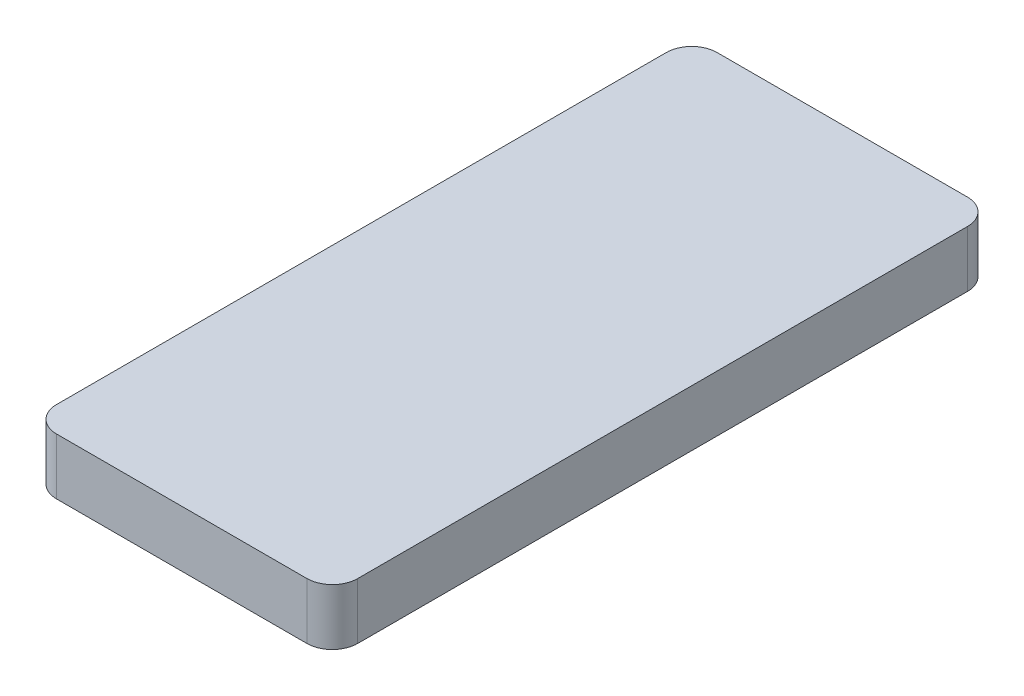
ISO-10303-21;
HEADER;
FILE_DESCRIPTION(('STEP AP214'),'2;1');
FILE_NAME('part.step','',(''),(''),'','','');
FILE_SCHEMA(('AUTOMOTIVE_DESIGN { 1 0 10303 214 1 1 1 1 }'));
ENDSEC;
DATA;
#1=APPLICATION_CONTEXT('core data for automotive mechanical design processes');
#2=APPLICATION_PROTOCOL_DEFINITION('international standard','automotive_design',2000,#1);
#3=PRODUCT_CONTEXT('',#1,'mechanical');
#4=PRODUCT('Part','Part','',(#3));
#5=PRODUCT_RELATED_PRODUCT_CATEGORY('part','',(#4));
#6=PRODUCT_DEFINITION_FORMATION('','',#4);
#7=PRODUCT_DEFINITION_CONTEXT('part definition',#1,'design');
#8=PRODUCT_DEFINITION('design','',#6,#7);
#9=PRODUCT_DEFINITION_SHAPE('','',#8);
#10=(LENGTH_UNIT() NAMED_UNIT(*) SI_UNIT(.MILLI.,.METRE.));
#11=(NAMED_UNIT(*) PLANE_ANGLE_UNIT() SI_UNIT($,.RADIAN.));
#12=(NAMED_UNIT(*) SI_UNIT($,.STERADIAN.) SOLID_ANGLE_UNIT());
#13=UNCERTAINTY_MEASURE_WITH_UNIT(LENGTH_MEASURE(1.E-05),#10,'distance_accuracy_value','');
#14=(GEOMETRIC_REPRESENTATION_CONTEXT(3) GLOBAL_UNCERTAINTY_ASSIGNED_CONTEXT((#13)) GLOBAL_UNIT_ASSIGNED_CONTEXT((#10,
#11,#12)) REPRESENTATION_CONTEXT('',''));
#15=CARTESIAN_POINT('',(0.,0.,0.));
#16=DIRECTION('',(0.,0.,1.));
#17=DIRECTION('',(1.,0.,0.));
#18=AXIS2_PLACEMENT_3D('',#15,#16,#17);
#19=CARTESIAN_POINT('',(-7.,15.5,-7.));
#20=DIRECTION('',(0.,-1.,0.));
#21=DIRECTION('',(0.,0.,-1.));
#22=AXIS2_PLACEMENT_3D('',#19,#20,#21);
#23=CYLINDRICAL_SURFACE('',#22,7.);
#24=CARTESIAN_POINT('',(-7.,0.,-7.));
#25=DIRECTION('',(0.,1.,0.));
#26=DIRECTION('',(0.,0.,1.));
#27=AXIS2_PLACEMENT_3D('',#24,#25,#26);
#28=CIRCLE('',#27,7.);
#29=CARTESIAN_POINT('',(-7.00000000000005,0.,0.));
#30=VERTEX_POINT('',#29);
#31=CARTESIAN_POINT('',(0.,0.,-7.00000000000005));
#32=VERTEX_POINT('',#31);
#33=EDGE_CURVE('E151',#30,#32,#28,.T.);
#34=ORIENTED_EDGE('',*,*,#33,.T.);
#35=DIRECTION('',(0.,-1.,0.));
#36=VECTOR('',#35,1.);
#37=CARTESIAN_POINT('',(0.,15.5,-7.00000000000005));
#38=LINE('',#37,#36);
#39=CARTESIAN_POINT('',(0.,15.5,-7.00000000000005));
#40=VERTEX_POINT('',#39);
#41=EDGE_CURVE('E11',#40,#32,#38,.T.);
#42=ORIENTED_EDGE('',*,*,#41,.F.);
#43=CARTESIAN_POINT('',(-7.,15.5,-7.));
#44=DIRECTION('',(0.,1.,0.));
#45=DIRECTION('',(0.,0.,1.));
#46=AXIS2_PLACEMENT_3D('',#43,#44,#45);
#47=CIRCLE('',#46,7.);
#48=CARTESIAN_POINT('',(-7.00000000000005,15.5,0.));
#49=VERTEX_POINT('',#48);
#50=EDGE_CURVE('E175',#49,#40,#47,.T.);
#51=ORIENTED_EDGE('',*,*,#50,.F.);
#52=DIRECTION('',(0.,-1.,0.));
#53=VECTOR('',#52,1.);
#54=CARTESIAN_POINT('',(-7.00000000000005,15.5,0.));
#55=LINE('',#54,#53);
#56=EDGE_CURVE('E147',#49,#30,#55,.T.);
#57=ORIENTED_EDGE('',*,*,#56,.T.);
#58=EDGE_LOOP('',(#34,#42,#51,#57));
#59=FACE_BOUND('',#58,.T.);
#60=ADVANCED_FACE('F38',(#59),#23,.T.);
#61=CARTESIAN_POINT('',(0.,15.5,-7.00000000000005));
#62=DIRECTION('',(-1.,0.,0.));
#63=DIRECTION('',(0.,0.,1.));
#64=AXIS2_PLACEMENT_3D('',#61,#62,#63);
#65=PLANE('',#64);
#66=DIRECTION('',(0.,0.,-1.));
#67=VECTOR('',#66,1.);
#68=CARTESIAN_POINT('',(0.,0.,-7.00000000000005));
#69=LINE('',#68,#67);
#70=CARTESIAN_POINT('',(0.,0.,-175.));
#71=VERTEX_POINT('',#70);
#72=EDGE_CURVE('E155',#32,#71,#69,.T.);
#73=ORIENTED_EDGE('',*,*,#72,.T.);
#74=DIRECTION('',(0.,-1.,0.));
#75=VECTOR('',#74,1.);
#76=CARTESIAN_POINT('',(0.,15.5,-175.));
#77=LINE('',#76,#75);
#78=CARTESIAN_POINT('',(0.,15.5,-175.));
#79=VERTEX_POINT('',#78);
#80=EDGE_CURVE('E46',#79,#71,#77,.T.);
#81=ORIENTED_EDGE('',*,*,#80,.F.);
#82=DIRECTION('',(0.,0.,-1.));
#83=VECTOR('',#82,1.);
#84=CARTESIAN_POINT('',(0.,15.5,-7.00000000000005));
#85=LINE('',#84,#83);
#86=EDGE_CURVE('E103',#40,#79,#85,.T.);
#87=ORIENTED_EDGE('',*,*,#86,.F.);
#88=ORIENTED_EDGE('',*,*,#41,.T.);
#89=EDGE_LOOP('',(#73,#81,#87,#88));
#90=FACE_BOUND('',#89,.T.);
#91=ADVANCED_FACE('F373',(#90),#65,.F.);
#92=CARTESIAN_POINT('',(-7.,15.5,-175.));
#93=DIRECTION('',(0.,-1.,0.));
#94=DIRECTION('',(0.,0.,-1.));
#95=AXIS2_PLACEMENT_3D('',#92,#93,#94);
#96=CYLINDRICAL_SURFACE('',#95,7.);
#97=CARTESIAN_POINT('',(-7.,0.,-175.));
#98=DIRECTION('',(0.,1.,0.));
#99=DIRECTION('',(0.,0.,1.));
#100=AXIS2_PLACEMENT_3D('',#97,#98,#99);
#101=CIRCLE('',#100,7.);
#102=CARTESIAN_POINT('',(-7.00000000000005,0.,-182.));
#103=VERTEX_POINT('',#102);
#104=EDGE_CURVE('E159',#71,#103,#101,.T.);
#105=ORIENTED_EDGE('',*,*,#104,.T.);
#106=DIRECTION('',(0.,-1.,0.));
#107=VECTOR('',#106,1.);
#108=CARTESIAN_POINT('',(-7.00000000000005,15.5,-182.));
#109=LINE('',#108,#107);
#110=CARTESIAN_POINT('',(-7.00000000000005,15.5,-182.));
#111=VERTEX_POINT('',#110);
#112=EDGE_CURVE('E186',#111,#103,#109,.T.);
#113=ORIENTED_EDGE('',*,*,#112,.F.);
#114=CARTESIAN_POINT('',(-7.,15.5,-175.));
#115=DIRECTION('',(0.,1.,0.));
#116=DIRECTION('',(0.,0.,1.));
#117=AXIS2_PLACEMENT_3D('',#114,#115,#116);
#118=CIRCLE('',#117,7.);
#119=EDGE_CURVE('E196',#79,#111,#118,.T.);
#120=ORIENTED_EDGE('',*,*,#119,.F.);
#121=ORIENTED_EDGE('',*,*,#80,.T.);
#122=EDGE_LOOP('',(#105,#113,#120,#121));
#123=FACE_BOUND('',#122,.T.);
#124=ADVANCED_FACE('F194',(#123),#96,.T.);
#125=CARTESIAN_POINT('',(-7.00000000000005,15.5,-182.));
#126=DIRECTION('',(0.,0.,1.));
#127=DIRECTION('',(1.,0.,0.));
#128=AXIS2_PLACEMENT_3D('',#125,#126,#127);
#129=PLANE('',#128);
#130=DIRECTION('',(-1.,0.,0.));
#131=VECTOR('',#130,1.);
#132=CARTESIAN_POINT('',(-7.00000000000005,0.,-182.));
#133=LINE('',#132,#131);
#134=CARTESIAN_POINT('',(-76.,0.,-182.));
#135=VERTEX_POINT('',#134);
#136=EDGE_CURVE('E162',#103,#135,#133,.T.);
#137=ORIENTED_EDGE('',*,*,#136,.T.);
#138=DIRECTION('',(0.,-1.,0.));
#139=VECTOR('',#138,1.);
#140=CARTESIAN_POINT('',(-76.,15.5,-182.));
#141=LINE('',#140,#139);
#142=CARTESIAN_POINT('',(-76.,15.5,-182.));
#143=VERTEX_POINT('',#142);
#144=EDGE_CURVE('E182',#143,#135,#141,.T.);
#145=ORIENTED_EDGE('',*,*,#144,.F.);
#146=DIRECTION('',(-1.,0.,0.));
#147=VECTOR('',#146,1.);
#148=CARTESIAN_POINT('',(-7.00000000000005,15.5,-182.));
#149=LINE('',#148,#147);
#150=EDGE_CURVE('E209',#111,#143,#149,.T.);
#151=ORIENTED_EDGE('',*,*,#150,.F.);
#152=ORIENTED_EDGE('',*,*,#112,.T.);
#153=EDGE_LOOP('',(#137,#145,#151,#152));
#154=FACE_BOUND('',#153,.T.);
#155=ADVANCED_FACE('F204',(#154),#129,.F.);
#156=CARTESIAN_POINT('',(-76.,15.5,-175.));
#157=DIRECTION('',(0.,-1.,0.));
#158=DIRECTION('',(0.,0.,-1.));
#159=AXIS2_PLACEMENT_3D('',#156,#157,#158);
#160=CYLINDRICAL_SURFACE('',#159,7.00000000000001);
#161=CARTESIAN_POINT('',(-76.,0.,-175.));
#162=DIRECTION('',(0.,1.,0.));
#163=DIRECTION('',(0.,0.,1.));
#164=AXIS2_PLACEMENT_3D('',#161,#162,#163);
#165=CIRCLE('',#164,7.00000000000001);
#166=CARTESIAN_POINT('',(-83.,0.,-175.));
#167=VERTEX_POINT('',#166);
#168=EDGE_CURVE('E165',#135,#167,#165,.T.);
#169=ORIENTED_EDGE('',*,*,#168,.T.);
#170=DIRECTION('',(0.,-1.,0.));
#171=VECTOR('',#170,1.);
#172=CARTESIAN_POINT('',(-83.,15.5,-175.));
#173=LINE('',#172,#171);
#174=CARTESIAN_POINT('',(-83.,15.5,-175.));
#175=VERTEX_POINT('',#174);
#176=EDGE_CURVE('E140',#175,#167,#173,.T.);
#177=ORIENTED_EDGE('',*,*,#176,.F.);
#178=CARTESIAN_POINT('',(-76.,15.5,-175.));
#179=DIRECTION('',(0.,1.,0.));
#180=DIRECTION('',(0.,0.,1.));
#181=AXIS2_PLACEMENT_3D('',#178,#179,#180);
#182=CIRCLE('',#181,7.00000000000001);
#183=EDGE_CURVE('E126',#143,#175,#182,.T.);
#184=ORIENTED_EDGE('',*,*,#183,.F.);
#185=ORIENTED_EDGE('',*,*,#144,.T.);
#186=EDGE_LOOP('',(#169,#177,#184,#185));
#187=FACE_BOUND('',#186,.T.);
#188=ADVANCED_FACE('F207',(#187),#160,.T.);
#189=CARTESIAN_POINT('',(-83.,15.5,-7.00000000000004));
#190=DIRECTION('',(1.,0.,0.));
#191=DIRECTION('',(0.,0.,-1.));
#192=AXIS2_PLACEMENT_3D('',#189,#190,#191);
#193=PLANE('',#192);
#194=DIRECTION('',(0.,0.,1.));
#195=VECTOR('',#194,1.);
#196=CARTESIAN_POINT('',(-83.,0.,-7.00000000000004));
#197=LINE('',#196,#195);
#198=CARTESIAN_POINT('',(-83.,0.,-7.00000000000004));
#199=VERTEX_POINT('',#198);
#200=EDGE_CURVE('E136',#167,#199,#197,.T.);
#201=ORIENTED_EDGE('',*,*,#200,.T.);
#202=DIRECTION('',(0.,-1.,0.));
#203=VECTOR('',#202,1.);
#204=CARTESIAN_POINT('',(-83.,15.5,-7.00000000000004));
#205=LINE('',#204,#203);
#206=CARTESIAN_POINT('',(-83.,15.5,-7.00000000000004));
#207=VERTEX_POINT('',#206);
#208=EDGE_CURVE('E133',#207,#199,#205,.T.);
#209=ORIENTED_EDGE('',*,*,#208,.F.);
#210=DIRECTION('',(0.,0.,1.));
#211=VECTOR('',#210,1.);
#212=CARTESIAN_POINT('',(-83.,15.5,-7.00000000000004));
#213=LINE('',#212,#211);
#214=EDGE_CURVE('E119',#175,#207,#213,.T.);
#215=ORIENTED_EDGE('',*,*,#214,.F.);
#216=ORIENTED_EDGE('',*,*,#176,.T.);
#217=EDGE_LOOP('',(#201,#209,#215,#216));
#218=FACE_BOUND('',#217,.T.);
#219=ADVANCED_FACE('F134',(#218),#193,.F.);
#220=CARTESIAN_POINT('',(-76.,15.5,-6.99999999999999));
#221=DIRECTION('',(0.,-1.,0.));
#222=DIRECTION('',(0.,0.,-1.));
#223=AXIS2_PLACEMENT_3D('',#220,#221,#222);
#224=CYLINDRICAL_SURFACE('',#223,7.);
#225=CARTESIAN_POINT('',(-76.,0.,-6.99999999999999));
#226=DIRECTION('',(0.,1.,0.));
#227=DIRECTION('',(0.,0.,-1.));
#228=AXIS2_PLACEMENT_3D('',#225,#226,#227);
#229=CIRCLE('',#228,7.);
#230=CARTESIAN_POINT('',(-76.,0.,0.));
#231=VERTEX_POINT('',#230);
#232=EDGE_CURVE('E170',#199,#231,#229,.T.);
#233=ORIENTED_EDGE('',*,*,#232,.T.);
#234=DIRECTION('',(0.,-1.,0.));
#235=VECTOR('',#234,1.);
#236=CARTESIAN_POINT('',(-76.,15.5,0.));
#237=LINE('',#236,#235);
#238=CARTESIAN_POINT('',(-76.,15.5,0.));
#239=VERTEX_POINT('',#238);
#240=EDGE_CURVE('E141',#239,#231,#237,.T.);
#241=ORIENTED_EDGE('',*,*,#240,.F.);
#242=CARTESIAN_POINT('',(-76.,15.5,-6.99999999999999));
#243=DIRECTION('',(0.,1.,0.));
#244=DIRECTION('',(0.,0.,-1.));
#245=AXIS2_PLACEMENT_3D('',#242,#243,#244);
#246=CIRCLE('',#245,7.);
#247=EDGE_CURVE('E123',#207,#239,#246,.T.);
#248=ORIENTED_EDGE('',*,*,#247,.F.);
#249=ORIENTED_EDGE('',*,*,#208,.T.);
#250=EDGE_LOOP('',(#233,#241,#248,#249));
#251=FACE_BOUND('',#250,.T.);
#252=ADVANCED_FACE('F143',(#251),#224,.T.);
#253=CARTESIAN_POINT('',(-7.00000000000005,15.5,0.));
#254=DIRECTION('',(0.,0.,-1.));
#255=DIRECTION('',(-1.,0.,0.));
#256=AXIS2_PLACEMENT_3D('',#253,#254,#255);
#257=PLANE('',#256);
#258=DIRECTION('',(1.,0.,0.));
#259=VECTOR('',#258,1.);
#260=CARTESIAN_POINT('',(-7.00000000000005,0.,0.));
#261=LINE('',#260,#259);
#262=EDGE_CURVE('E95',#231,#30,#261,.T.);
#263=ORIENTED_EDGE('',*,*,#262,.T.);
#264=ORIENTED_EDGE('',*,*,#56,.F.);
#265=DIRECTION('',(1.,0.,0.));
#266=VECTOR('',#265,1.);
#267=CARTESIAN_POINT('',(-7.00000000000005,15.5,0.));
#268=LINE('',#267,#266);
#269=EDGE_CURVE('E62',#239,#49,#268,.T.);
#270=ORIENTED_EDGE('',*,*,#269,.F.);
#271=ORIENTED_EDGE('',*,*,#240,.T.);
#272=EDGE_LOOP('',(#263,#264,#270,#271));
#273=FACE_BOUND('',#272,.T.);
#274=ADVANCED_FACE('F380',(#273),#257,.F.);
#275=CARTESIAN_POINT('',(-7.,15.5,-7.));
#276=DIRECTION('',(0.,1.,0.));
#277=DIRECTION('',(0.,0.,1.));
#278=AXIS2_PLACEMENT_3D('',#275,#276,#277);
#279=PLANE('',#278);
#280=ORIENTED_EDGE('',*,*,#50,.T.);
#281=ORIENTED_EDGE('',*,*,#86,.T.);
#282=ORIENTED_EDGE('',*,*,#119,.T.);
#283=ORIENTED_EDGE('',*,*,#150,.T.);
#284=ORIENTED_EDGE('',*,*,#183,.T.);
#285=ORIENTED_EDGE('',*,*,#214,.T.);
#286=ORIENTED_EDGE('',*,*,#247,.T.);
#287=ORIENTED_EDGE('',*,*,#269,.T.);
#288=EDGE_LOOP('',(#280,#281,#282,#283,#284,#285,#286,#287));
#289=FACE_BOUND('',#288,.T.);
#290=ADVANCED_FACE('F121',(#289),#279,.T.);
#291=CARTESIAN_POINT('',(-7.,0.,-7.));
#292=DIRECTION('',(0.,1.,0.));
#293=DIRECTION('',(0.,0.,1.));
#294=AXIS2_PLACEMENT_3D('',#291,#292,#293);
#295=PLANE('',#294);
#296=DIRECTION('',(1.,0.,0.));
#297=VECTOR('',#296,1.);
#298=CARTESIAN_POINT('',(-7.00000000000005,0.,-2.));
#299=LINE('',#298,#297);
#300=CARTESIAN_POINT('',(-76.,0.,-1.99999999999999));
#301=VERTEX_POINT('',#300);
#302=CARTESIAN_POINT('',(-7.00000000000005,0.,-2.));
#303=VERTEX_POINT('',#302);
#304=EDGE_CURVE('E242',#301,#303,#299,.T.);
#305=ORIENTED_EDGE('',*,*,#304,.T.);
#306=CARTESIAN_POINT('',(-7.,0.,-7.));
#307=DIRECTION('',(0.,1.,0.));
#308=DIRECTION('',(0.,0.,1.));
#309=AXIS2_PLACEMENT_3D('',#306,#307,#308);
#310=CIRCLE('',#309,5.);
#311=CARTESIAN_POINT('',(-2.,0.,-7.00000000000005));
#312=VERTEX_POINT('',#311);
#313=EDGE_CURVE('E223',#303,#312,#310,.T.);
#314=ORIENTED_EDGE('',*,*,#313,.T.);
#315=DIRECTION('',(0.,0.,-1.));
#316=VECTOR('',#315,1.);
#317=CARTESIAN_POINT('',(-2.,0.,-7.00000000000005));
#318=LINE('',#317,#316);
#319=CARTESIAN_POINT('',(-2.,0.,-175.));
#320=VERTEX_POINT('',#319);
#321=EDGE_CURVE('E219',#312,#320,#318,.T.);
#322=ORIENTED_EDGE('',*,*,#321,.T.);
#323=CARTESIAN_POINT('',(-7.,0.,-175.));
#324=DIRECTION('',(0.,1.,0.));
#325=DIRECTION('',(0.,0.,1.));
#326=AXIS2_PLACEMENT_3D('',#323,#324,#325);
#327=CIRCLE('',#326,5.);
#328=CARTESIAN_POINT('',(-7.00000000000003,0.,-180.));
#329=VERTEX_POINT('',#328);
#330=EDGE_CURVE('E53',#320,#329,#327,.T.);
#331=ORIENTED_EDGE('',*,*,#330,.T.);
#332=DIRECTION('',(-1.,0.,0.));
#333=VECTOR('',#332,1.);
#334=CARTESIAN_POINT('',(-7.00000000000005,0.,-180.));
#335=LINE('',#334,#333);
#336=CARTESIAN_POINT('',(-76.,0.,-180.));
#337=VERTEX_POINT('',#336);
#338=EDGE_CURVE('E226',#329,#337,#335,.T.);
#339=ORIENTED_EDGE('',*,*,#338,.T.);
#340=CARTESIAN_POINT('',(-76.,0.,-175.));
#341=DIRECTION('',(0.,1.,0.));
#342=DIRECTION('',(0.,0.,1.));
#343=AXIS2_PLACEMENT_3D('',#340,#341,#342);
#344=CIRCLE('',#343,5.00000000000001);
#345=CARTESIAN_POINT('',(-81.,0.,-175.));
#346=VERTEX_POINT('',#345);
#347=EDGE_CURVE('E230',#337,#346,#344,.T.);
#348=ORIENTED_EDGE('',*,*,#347,.T.);
#349=DIRECTION('',(0.,0.,1.));
#350=VECTOR('',#349,1.);
#351=CARTESIAN_POINT('',(-81.,0.,-7.00000000000004));
#352=LINE('',#351,#350);
#353=CARTESIAN_POINT('',(-81.,0.,-7.00000000000004));
#354=VERTEX_POINT('',#353);
#355=EDGE_CURVE('E234',#346,#354,#352,.T.);
#356=ORIENTED_EDGE('',*,*,#355,.T.);
#357=CARTESIAN_POINT('',(-76.,0.,-6.99999999999999));
#358=DIRECTION('',(0.,1.,0.));
#359=DIRECTION('',(0.,0.,1.));
#360=AXIS2_PLACEMENT_3D('',#357,#358,#359);
#361=CIRCLE('',#360,5.);
#362=EDGE_CURVE('E238',#354,#301,#361,.T.);
#363=ORIENTED_EDGE('',*,*,#362,.T.);
#364=EDGE_LOOP('',(#305,#314,#322,#331,#339,#348,#356,#363));
#365=FACE_BOUND('',#364,.T.);
#366=ORIENTED_EDGE('',*,*,#33,.F.);
#367=ORIENTED_EDGE('',*,*,#262,.F.);
#368=ORIENTED_EDGE('',*,*,#232,.F.);
#369=ORIENTED_EDGE('',*,*,#200,.F.);
#370=ORIENTED_EDGE('',*,*,#168,.F.);
#371=ORIENTED_EDGE('',*,*,#136,.F.);
#372=ORIENTED_EDGE('',*,*,#104,.F.);
#373=ORIENTED_EDGE('',*,*,#72,.F.);
#374=EDGE_LOOP('',(#366,#367,#368,#369,#370,#371,#372,#373));
#375=FACE_BOUND('',#374,.T.);
#376=ADVANCED_FACE('F200',(#365,#375),#295,.F.);
#377=CARTESIAN_POINT('',(-7.,15.5,-7.));
#378=DIRECTION('',(0.,-1.,0.));
#379=DIRECTION('',(0.,0.,-1.));
#380=AXIS2_PLACEMENT_3D('',#377,#378,#379);
#381=CYLINDRICAL_SURFACE('',#380,5.);
#382=ORIENTED_EDGE('',*,*,#313,.F.);
#383=DIRECTION('',(0.,-1.,0.));
#384=VECTOR('',#383,1.);
#385=CARTESIAN_POINT('',(-7.00000000000003,15.5,-2.));
#386=LINE('',#385,#384);
#387=CARTESIAN_POINT('',(-7.00000000000003,13.5,-2.));
#388=VERTEX_POINT('',#387);
#389=EDGE_CURVE('E254',#388,#303,#386,.T.);
#390=ORIENTED_EDGE('',*,*,#389,.F.);
#391=CARTESIAN_POINT('',(-7.,13.5,-7.));
#392=DIRECTION('',(0.,1.,0.));
#393=DIRECTION('',(0.,0.,1.));
#394=AXIS2_PLACEMENT_3D('',#391,#392,#393);
#395=CIRCLE('',#394,5.);
#396=CARTESIAN_POINT('',(-2.,13.5,-7.00000000000005));
#397=VERTEX_POINT('',#396);
#398=EDGE_CURVE('E246',#388,#397,#395,.T.);
#399=ORIENTED_EDGE('',*,*,#398,.T.);
#400=DIRECTION('',(0.,1.,0.));
#401=VECTOR('',#400,1.);
#402=CARTESIAN_POINT('',(-2.,15.5,-7.00000000000005));
#403=LINE('',#402,#401);
#404=EDGE_CURVE('E156',#397,#312,#403,.F.);
#405=ORIENTED_EDGE('',*,*,#404,.T.);
#406=EDGE_LOOP('',(#382,#390,#399,#405));
#407=FACE_BOUND('',#406,.T.);
#408=ADVANCED_FACE('F312',(#407),#381,.F.);
#409=CARTESIAN_POINT('',(-2.,15.5,-7.00000000000005));
#410=DIRECTION('',(-1.,0.,0.));
#411=DIRECTION('',(0.,0.,1.));
#412=AXIS2_PLACEMENT_3D('',#409,#410,#411);
#413=PLANE('',#412);
#414=ORIENTED_EDGE('',*,*,#321,.F.);
#415=ORIENTED_EDGE('',*,*,#404,.F.);
#416=DIRECTION('',(0.,0.,-1.));
#417=VECTOR('',#416,1.);
#418=CARTESIAN_POINT('',(-2.,13.5,-7.00000000000005));
#419=LINE('',#418,#417);
#420=CARTESIAN_POINT('',(-2.,13.5,-175.));
#421=VERTEX_POINT('',#420);
#422=EDGE_CURVE('E292',#397,#421,#419,.T.);
#423=ORIENTED_EDGE('',*,*,#422,.T.);
#424=DIRECTION('',(0.,-1.,0.));
#425=VECTOR('',#424,1.);
#426=CARTESIAN_POINT('',(-2.,15.5,-175.));
#427=LINE('',#426,#425);
#428=EDGE_CURVE('E295',#421,#320,#427,.T.);
#429=ORIENTED_EDGE('',*,*,#428,.T.);
#430=EDGE_LOOP('',(#414,#415,#423,#429));
#431=FACE_BOUND('',#430,.T.);
#432=ADVANCED_FACE('F442',(#431),#413,.T.);
#433=CARTESIAN_POINT('',(-7.,15.5,-175.));
#434=DIRECTION('',(0.,-1.,0.));
#435=DIRECTION('',(0.,0.,-1.));
#436=AXIS2_PLACEMENT_3D('',#433,#434,#435);
#437=CYLINDRICAL_SURFACE('',#436,5.);
#438=ORIENTED_EDGE('',*,*,#330,.F.);
#439=ORIENTED_EDGE('',*,*,#428,.F.);
#440=CARTESIAN_POINT('',(-7.,13.5,-175.));
#441=DIRECTION('',(0.,1.,0.));
#442=DIRECTION('',(0.,0.,1.));
#443=AXIS2_PLACEMENT_3D('',#440,#441,#442);
#444=CIRCLE('',#443,5.);
#445=CARTESIAN_POINT('',(-7.00000000000005,13.5,-180.));
#446=VERTEX_POINT('',#445);
#447=EDGE_CURVE('E284',#421,#446,#444,.T.);
#448=ORIENTED_EDGE('',*,*,#447,.T.);
#449=DIRECTION('',(0.,1.,0.));
#450=VECTOR('',#449,1.);
#451=CARTESIAN_POINT('',(-7.00000000000005,15.5,-180.));
#452=LINE('',#451,#450);
#453=EDGE_CURVE('E288',#446,#329,#452,.F.);
#454=ORIENTED_EDGE('',*,*,#453,.T.);
#455=EDGE_LOOP('',(#438,#439,#448,#454));
#456=FACE_BOUND('',#455,.T.);
#457=ADVANCED_FACE('F341',(#456),#437,.F.);
#458=CARTESIAN_POINT('',(-7.00000000000005,15.5,-180.));
#459=DIRECTION('',(0.,0.,1.));
#460=DIRECTION('',(1.,0.,0.));
#461=AXIS2_PLACEMENT_3D('',#458,#459,#460);
#462=PLANE('',#461);
#463=ORIENTED_EDGE('',*,*,#338,.F.);
#464=ORIENTED_EDGE('',*,*,#453,.F.);
#465=DIRECTION('',(-1.,0.,0.));
#466=VECTOR('',#465,1.);
#467=CARTESIAN_POINT('',(-7.00000000000005,13.5,-180.));
#468=LINE('',#467,#466);
#469=CARTESIAN_POINT('',(-76.,13.5,-180.));
#470=VERTEX_POINT('',#469);
#471=EDGE_CURVE('E276',#446,#470,#468,.T.);
#472=ORIENTED_EDGE('',*,*,#471,.T.);
#473=DIRECTION('',(0.,-1.,0.));
#474=VECTOR('',#473,1.);
#475=CARTESIAN_POINT('',(-76.,15.5,-180.));
#476=LINE('',#475,#474);
#477=EDGE_CURVE('E280',#470,#337,#476,.T.);
#478=ORIENTED_EDGE('',*,*,#477,.T.);
#479=EDGE_LOOP('',(#463,#464,#472,#478));
#480=FACE_BOUND('',#479,.T.);
#481=ADVANCED_FACE('F346',(#480),#462,.T.);
#482=CARTESIAN_POINT('',(-76.,15.5,-175.));
#483=DIRECTION('',(0.,-1.,0.));
#484=DIRECTION('',(0.,0.,-1.));
#485=AXIS2_PLACEMENT_3D('',#482,#483,#484);
#486=CYLINDRICAL_SURFACE('',#485,5.00000000000001);
#487=ORIENTED_EDGE('',*,*,#347,.F.);
#488=ORIENTED_EDGE('',*,*,#477,.F.);
#489=CARTESIAN_POINT('',(-76.,13.5,-175.));
#490=DIRECTION('',(0.,1.,0.));
#491=DIRECTION('',(0.,0.,1.));
#492=AXIS2_PLACEMENT_3D('',#489,#490,#491);
#493=CIRCLE('',#492,5.00000000000001);
#494=CARTESIAN_POINT('',(-81.,13.5,-175.));
#495=VERTEX_POINT('',#494);
#496=EDGE_CURVE('E268',#470,#495,#493,.T.);
#497=ORIENTED_EDGE('',*,*,#496,.T.);
#498=DIRECTION('',(0.,1.,0.));
#499=VECTOR('',#498,1.);
#500=CARTESIAN_POINT('',(-81.,15.5,-175.));
#501=LINE('',#500,#499);
#502=EDGE_CURVE('E272',#495,#346,#501,.F.);
#503=ORIENTED_EDGE('',*,*,#502,.T.);
#504=EDGE_LOOP('',(#487,#488,#497,#503));
#505=FACE_BOUND('',#504,.T.);
#506=ADVANCED_FACE('F351',(#505),#486,.F.);
#507=CARTESIAN_POINT('',(-81.,15.5,-7.00000000000004));
#508=DIRECTION('',(1.,0.,0.));
#509=DIRECTION('',(0.,0.,-1.));
#510=AXIS2_PLACEMENT_3D('',#507,#508,#509);
#511=PLANE('',#510);
#512=ORIENTED_EDGE('',*,*,#355,.F.);
#513=ORIENTED_EDGE('',*,*,#502,.F.);
#514=DIRECTION('',(0.,0.,1.));
#515=VECTOR('',#514,1.);
#516=CARTESIAN_POINT('',(-81.,13.5,-7.00000000000004));
#517=LINE('',#516,#515);
#518=CARTESIAN_POINT('',(-81.,13.5,-7.00000000000002));
#519=VERTEX_POINT('',#518);
#520=EDGE_CURVE('E259',#495,#519,#517,.T.);
#521=ORIENTED_EDGE('',*,*,#520,.T.);
#522=DIRECTION('',(0.,-1.,0.));
#523=VECTOR('',#522,1.);
#524=CARTESIAN_POINT('',(-81.,15.5,-7.00000000000002));
#525=LINE('',#524,#523);
#526=EDGE_CURVE('E264',#519,#354,#525,.T.);
#527=ORIENTED_EDGE('',*,*,#526,.T.);
#528=EDGE_LOOP('',(#512,#513,#521,#527));
#529=FACE_BOUND('',#528,.T.);
#530=ADVANCED_FACE('F358',(#529),#511,.T.);
#531=CARTESIAN_POINT('',(-76.,15.5,-6.99999999999999));
#532=DIRECTION('',(0.,-1.,0.));
#533=DIRECTION('',(0.,0.,-1.));
#534=AXIS2_PLACEMENT_3D('',#531,#532,#533);
#535=CYLINDRICAL_SURFACE('',#534,5.);
#536=ORIENTED_EDGE('',*,*,#362,.F.);
#537=ORIENTED_EDGE('',*,*,#526,.F.);
#538=CARTESIAN_POINT('',(-76.,13.5,-6.99999999999999));
#539=DIRECTION('',(0.,1.,0.));
#540=DIRECTION('',(0.,0.,1.));
#541=AXIS2_PLACEMENT_3D('',#538,#539,#540);
#542=CIRCLE('',#541,5.);
#543=CARTESIAN_POINT('',(-76.,13.5,-1.99999999999999));
#544=VERTEX_POINT('',#543);
#545=EDGE_CURVE('E255',#519,#544,#542,.T.);
#546=ORIENTED_EDGE('',*,*,#545,.T.);
#547=DIRECTION('',(0.,1.,0.));
#548=VECTOR('',#547,1.);
#549=CARTESIAN_POINT('',(-76.,15.5,-1.99999999999999));
#550=LINE('',#549,#548);
#551=EDGE_CURVE('E260',#544,#301,#550,.F.);
#552=ORIENTED_EDGE('',*,*,#551,.T.);
#553=EDGE_LOOP('',(#536,#537,#546,#552));
#554=FACE_BOUND('',#553,.T.);
#555=ADVANCED_FACE('F362',(#554),#535,.F.);
#556=CARTESIAN_POINT('',(-7.00000000000005,15.5,-2.));
#557=DIRECTION('',(0.,0.,-1.));
#558=DIRECTION('',(-1.,0.,0.));
#559=AXIS2_PLACEMENT_3D('',#556,#557,#558);
#560=PLANE('',#559);
#561=ORIENTED_EDGE('',*,*,#304,.F.);
#562=ORIENTED_EDGE('',*,*,#551,.F.);
#563=DIRECTION('',(1.,0.,0.));
#564=VECTOR('',#563,1.);
#565=CARTESIAN_POINT('',(-7.00000000000005,13.5,-2.));
#566=LINE('',#565,#564);
#567=EDGE_CURVE('E250',#544,#388,#566,.T.);
#568=ORIENTED_EDGE('',*,*,#567,.T.);
#569=ORIENTED_EDGE('',*,*,#389,.T.);
#570=EDGE_LOOP('',(#561,#562,#568,#569));
#571=FACE_BOUND('',#570,.T.);
#572=ADVANCED_FACE('F327',(#571),#560,.T.);
#573=CARTESIAN_POINT('',(-7.,13.5,-7.));
#574=DIRECTION('',(0.,1.,0.));
#575=DIRECTION('',(0.,0.,1.));
#576=AXIS2_PLACEMENT_3D('',#573,#574,#575);
#577=PLANE('',#576);
#578=ORIENTED_EDGE('',*,*,#398,.F.);
#579=ORIENTED_EDGE('',*,*,#567,.F.);
#580=ORIENTED_EDGE('',*,*,#545,.F.);
#581=ORIENTED_EDGE('',*,*,#520,.F.);
#582=ORIENTED_EDGE('',*,*,#496,.F.);
#583=ORIENTED_EDGE('',*,*,#471,.F.);
#584=ORIENTED_EDGE('',*,*,#447,.F.);
#585=ORIENTED_EDGE('',*,*,#422,.F.);
#586=EDGE_LOOP('',(#578,#579,#580,#581,#582,#583,#584,#585));
#587=FACE_BOUND('',#586,.T.);
#588=ADVANCED_FACE('F369',(#587),#577,.F.);
#589=CLOSED_SHELL('',(#60,#91,#124,#155,#188,#219,#252,#274,#290,#376,#408,#432,#457,#481,#506,
#530,#555,#572,#588));
#590=MANIFOLD_SOLID_BREP('B2',#589);
#591=ADVANCED_BREP_SHAPE_REPRESENTATION('',(#18,#590),#14);
#592=SHAPE_DEFINITION_REPRESENTATION(#9,#591);
ENDSEC;
END-ISO-10303-21;
